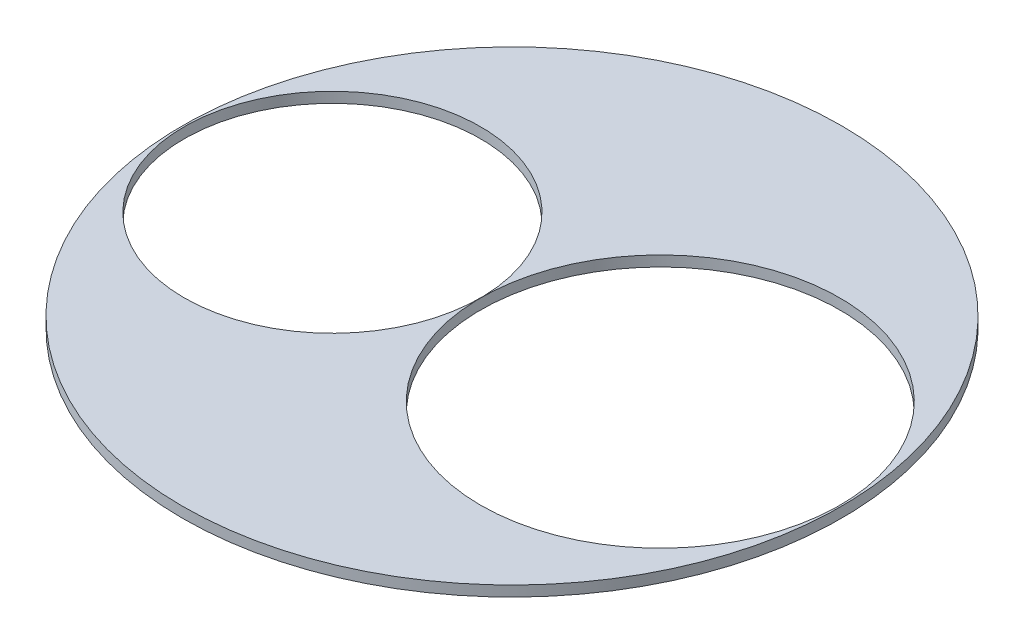
ISO-10303-21;
HEADER;
FILE_DESCRIPTION(('STEP AP214'),'2;1');
FILE_NAME('part.step','',(''),(''),'','','');
FILE_SCHEMA(('AUTOMOTIVE_DESIGN { 1 0 10303 214 1 1 1 1 }'));
ENDSEC;
DATA;
#1=APPLICATION_CONTEXT('core data for automotive mechanical design processes');
#2=APPLICATION_PROTOCOL_DEFINITION('international standard','automotive_design',2000,#1);
#3=PRODUCT_CONTEXT('',#1,'mechanical');
#4=PRODUCT('Part','Part','',(#3));
#5=PRODUCT_RELATED_PRODUCT_CATEGORY('part','',(#4));
#6=PRODUCT_DEFINITION_FORMATION('','',#4);
#7=PRODUCT_DEFINITION_CONTEXT('part definition',#1,'design');
#8=PRODUCT_DEFINITION('design','',#6,#7);
#9=PRODUCT_DEFINITION_SHAPE('','',#8);
#10=(LENGTH_UNIT() NAMED_UNIT(*) SI_UNIT(.MILLI.,.METRE.));
#11=(NAMED_UNIT(*) PLANE_ANGLE_UNIT() SI_UNIT($,.RADIAN.));
#12=(NAMED_UNIT(*) SI_UNIT($,.STERADIAN.) SOLID_ANGLE_UNIT());
#13=UNCERTAINTY_MEASURE_WITH_UNIT(LENGTH_MEASURE(1.E-05),#10,'distance_accuracy_value','');
#14=(GEOMETRIC_REPRESENTATION_CONTEXT(3) GLOBAL_UNCERTAINTY_ASSIGNED_CONTEXT((#13)) GLOBAL_UNIT_ASSIGNED_CONTEXT((#10,
#11,#12)) REPRESENTATION_CONTEXT('',''));
#15=CARTESIAN_POINT('',(0.,0.,0.));
#16=DIRECTION('',(0.,0.,1.));
#17=DIRECTION('',(1.,0.,0.));
#18=AXIS2_PLACEMENT_3D('',#15,#16,#17);
#19=CARTESIAN_POINT('',(0.,38.1,0.));
#20=DIRECTION('',(0.,1.,0.));
#21=DIRECTION('',(0.,0.,1.));
#22=AXIS2_PLACEMENT_3D('',#19,#20,#21);
#23=PLANE('',#22);
#24=CARTESIAN_POINT('',(539.876006558964,38.1,0.));
#25=DIRECTION('',(0.,1.,0.));
#26=DIRECTION('',(0.,0.,1.));
#27=AXIS2_PLACEMENT_3D('',#24,#25,#26);
#28=CIRCLE('',#27,654.05);
#29=CARTESIAN_POINT('',(539.876006558964,38.1,654.05));
#30=VERTEX_POINT('',#29);
#31=EDGE_CURVE('E46',#30,#30,#28,.T.);
#32=ORIENTED_EDGE('',*,*,#31,.F.);
#33=EDGE_LOOP('',(#32));
#34=FACE_BOUND('',#33,.T.);
#35=CARTESIAN_POINT('',(0.,38.1,0.));
#36=DIRECTION('',(0.,1.,0.));
#37=DIRECTION('',(0.,0.,1.));
#38=AXIS2_PLACEMENT_3D('',#35,#36,#37);
#39=CIRCLE('',#38,1200.);
#40=CARTESIAN_POINT('',(0.,38.1,1200.));
#41=VERTEX_POINT('',#40);
#42=EDGE_CURVE('E10',#41,#41,#39,.T.);
#43=ORIENTED_EDGE('',*,*,#42,.T.);
#44=EDGE_LOOP('',(#43));
#45=FACE_BOUND('',#44,.T.);
#46=CARTESIAN_POINT('',(-653.949393441036,38.1,0.));
#47=DIRECTION('',(0.,1.,0.));
#48=DIRECTION('',(0.,0.,1.));
#49=AXIS2_PLACEMENT_3D('',#46,#47,#48);
#50=CIRCLE('',#49,539.75);
#51=CARTESIAN_POINT('',(-653.949393441036,38.1,539.75));
#52=VERTEX_POINT('',#51);
#53=EDGE_CURVE('E51',#52,#52,#50,.T.);
#54=ORIENTED_EDGE('',*,*,#53,.F.);
#55=EDGE_LOOP('',(#54));
#56=FACE_BOUND('',#55,.T.);
#57=ADVANCED_FACE('F35',(#34,#45,#56),#23,.T.);
#58=CARTESIAN_POINT('',(0.,0.,0.));
#59=DIRECTION('',(0.,1.,0.));
#60=DIRECTION('',(0.,0.,1.));
#61=AXIS2_PLACEMENT_3D('',#58,#59,#60);
#62=PLANE('',#61);
#63=CARTESIAN_POINT('',(0.,0.,0.));
#64=DIRECTION('',(0.,1.,0.));
#65=DIRECTION('',(0.,0.,1.));
#66=AXIS2_PLACEMENT_3D('',#63,#64,#65);
#67=CIRCLE('',#66,1200.);
#68=CARTESIAN_POINT('',(0.,0.,1200.));
#69=VERTEX_POINT('',#68);
#70=EDGE_CURVE('E39',#69,#69,#67,.T.);
#71=ORIENTED_EDGE('',*,*,#70,.F.);
#72=EDGE_LOOP('',(#71));
#73=FACE_BOUND('',#72,.T.);
#74=CARTESIAN_POINT('',(539.876006558964,0.,0.));
#75=DIRECTION('',(0.,1.,0.));
#76=DIRECTION('',(0.,0.,1.));
#77=AXIS2_PLACEMENT_3D('',#74,#75,#76);
#78=CIRCLE('',#77,654.05);
#79=CARTESIAN_POINT('',(539.876006558964,0.,654.05));
#80=VERTEX_POINT('',#79);
#81=EDGE_CURVE('E48',#80,#80,#78,.T.);
#82=ORIENTED_EDGE('',*,*,#81,.T.);
#83=EDGE_LOOP('',(#82));
#84=FACE_BOUND('',#83,.T.);
#85=CARTESIAN_POINT('',(-653.949393441036,0.,0.));
#86=DIRECTION('',(0.,1.,0.));
#87=DIRECTION('',(0.,0.,1.));
#88=AXIS2_PLACEMENT_3D('',#85,#86,#87);
#89=CIRCLE('',#88,539.75);
#90=CARTESIAN_POINT('',(-653.949393441036,0.,539.75));
#91=VERTEX_POINT('',#90);
#92=EDGE_CURVE('E54',#91,#91,#89,.T.);
#93=ORIENTED_EDGE('',*,*,#92,.T.);
#94=EDGE_LOOP('',(#93));
#95=FACE_BOUND('',#94,.T.);
#96=ADVANCED_FACE('F64',(#73,#84,#95),#62,.F.);
#97=CARTESIAN_POINT('',(0.,38.1,0.));
#98=DIRECTION('',(0.,-1.,0.));
#99=DIRECTION('',(0.,0.,-1.));
#100=AXIS2_PLACEMENT_3D('',#97,#98,#99);
#101=CYLINDRICAL_SURFACE('',#100,1200.);
#102=ORIENTED_EDGE('',*,*,#42,.F.);
#103=EDGE_LOOP('',(#102));
#104=FACE_BOUND('',#103,.T.);
#105=ORIENTED_EDGE('',*,*,#70,.T.);
#106=EDGE_LOOP('',(#105));
#107=FACE_BOUND('',#106,.T.);
#108=ADVANCED_FACE('F37',(#104,#107),#101,.T.);
#109=CARTESIAN_POINT('',(539.876006558964,38.1,0.));
#110=DIRECTION('',(0.,-1.,0.));
#111=DIRECTION('',(0.,0.,-1.));
#112=AXIS2_PLACEMENT_3D('',#109,#110,#111);
#113=CYLINDRICAL_SURFACE('',#112,654.05);
#114=ORIENTED_EDGE('',*,*,#31,.T.);
#115=EDGE_LOOP('',(#114));
#116=FACE_BOUND('',#115,.T.);
#117=ORIENTED_EDGE('',*,*,#81,.F.);
#118=EDGE_LOOP('',(#117));
#119=FACE_BOUND('',#118,.T.);
#120=ADVANCED_FACE('F73',(#116,#119),#113,.F.);
#121=CARTESIAN_POINT('',(-653.949393441036,38.1,0.));
#122=DIRECTION('',(0.,-1.,0.));
#123=DIRECTION('',(0.,0.,-1.));
#124=AXIS2_PLACEMENT_3D('',#121,#122,#123);
#125=CYLINDRICAL_SURFACE('',#124,539.75);
#126=ORIENTED_EDGE('',*,*,#53,.T.);
#127=EDGE_LOOP('',(#126));
#128=FACE_BOUND('',#127,.T.);
#129=ORIENTED_EDGE('',*,*,#92,.F.);
#130=EDGE_LOOP('',(#129));
#131=FACE_BOUND('',#130,.T.);
#132=ADVANCED_FACE('F60',(#128,#131),#125,.F.);
#133=CLOSED_SHELL('',(#57,#96,#108,#120,#132));
#134=MANIFOLD_SOLID_BREP('B2',#133);
#135=ADVANCED_BREP_SHAPE_REPRESENTATION('',(#18,#134),#14);
#136=SHAPE_DEFINITION_REPRESENTATION(#9,#135);
ENDSEC;
END-ISO-10303-21;
